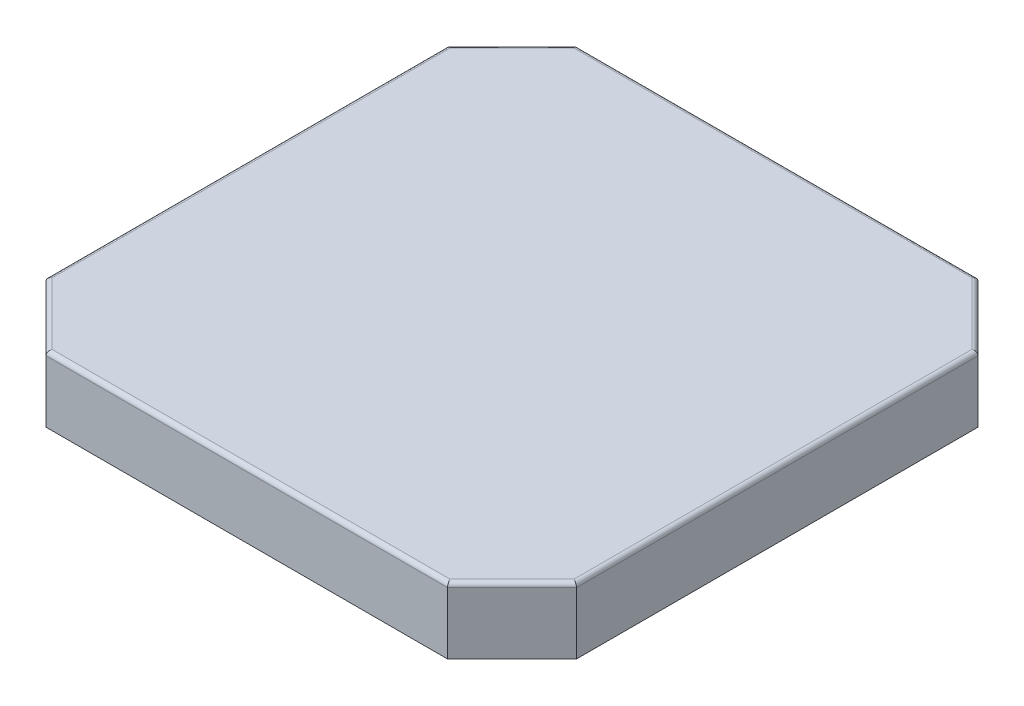
ISO-10303-21;
HEADER;
FILE_DESCRIPTION(('STEP AP214'),'2;1');
FILE_NAME('part.step','',(''),(''),'','','');
FILE_SCHEMA(('AUTOMOTIVE_DESIGN { 1 0 10303 214 1 1 1 1 }'));
ENDSEC;
DATA;
#1=APPLICATION_CONTEXT('core data for automotive mechanical design processes');
#2=APPLICATION_PROTOCOL_DEFINITION('international standard','automotive_design',2000,#1);
#3=PRODUCT_CONTEXT('',#1,'mechanical');
#4=PRODUCT('Part','Part','',(#3));
#5=PRODUCT_RELATED_PRODUCT_CATEGORY('part','',(#4));
#6=PRODUCT_DEFINITION_FORMATION('','',#4);
#7=PRODUCT_DEFINITION_CONTEXT('part definition',#1,'design');
#8=PRODUCT_DEFINITION('design','',#6,#7);
#9=PRODUCT_DEFINITION_SHAPE('','',#8);
#10=(LENGTH_UNIT() NAMED_UNIT(*) SI_UNIT(.MILLI.,.METRE.));
#11=(NAMED_UNIT(*) PLANE_ANGLE_UNIT() SI_UNIT($,.RADIAN.));
#12=(NAMED_UNIT(*) SI_UNIT($,.STERADIAN.) SOLID_ANGLE_UNIT());
#13=UNCERTAINTY_MEASURE_WITH_UNIT(LENGTH_MEASURE(1.E-05),#10,'distance_accuracy_value','');
#14=(GEOMETRIC_REPRESENTATION_CONTEXT(3) GLOBAL_UNCERTAINTY_ASSIGNED_CONTEXT((#13)) GLOBAL_UNIT_ASSIGNED_CONTEXT((#10,
#11,#12)) REPRESENTATION_CONTEXT('',''));
#15=CARTESIAN_POINT('',(0.,0.,0.));
#16=DIRECTION('',(0.,0.,1.));
#17=DIRECTION('',(1.,0.,0.));
#18=AXIS2_PLACEMENT_3D('',#15,#16,#17);
#19=CARTESIAN_POINT('',(0.,3.08,-24.7));
#20=DIRECTION('',(0.,0.,1.));
#21=DIRECTION('',(1.,0.,0.));
#22=AXIS2_PLACEMENT_3D('',#19,#20,#21);
#23=PLANE('',#22);
#24=DIRECTION('',(-1.,0.,0.));
#25=VECTOR('',#24,1.);
#26=CARTESIAN_POINT('',(0.,0.,-24.7));
#27=LINE('',#26,#25);
#28=CARTESIAN_POINT('',(21.7,0.,-24.7));
#29=VERTEX_POINT('',#28);
#30=CARTESIAN_POINT('',(15.35,0.,-24.7));
#31=VERTEX_POINT('',#30);
#32=EDGE_CURVE('E288',#29,#31,#27,.T.);
#33=ORIENTED_EDGE('',*,*,#32,.T.);
#34=DIRECTION('',(0.,-1.,0.));
#35=VECTOR('',#34,1.);
#36=CARTESIAN_POINT('',(15.35,0.,-24.7));
#37=LINE('',#36,#35);
#38=CARTESIAN_POINT('',(15.35,2.88,-24.7));
#39=VERTEX_POINT('',#38);
#40=EDGE_CURVE('E262',#39,#31,#37,.T.);
#41=ORIENTED_EDGE('',*,*,#40,.F.);
#42=DIRECTION('',(-1.,0.,0.));
#43=VECTOR('',#42,1.);
#44=CARTESIAN_POINT('',(0.,2.88,-24.7));
#45=LINE('',#44,#43);
#46=CARTESIAN_POINT('',(21.7,2.88,-24.7));
#47=VERTEX_POINT('',#46);
#48=EDGE_CURVE('E349',#39,#47,#45,.F.);
#49=ORIENTED_EDGE('',*,*,#48,.T.);
#50=DIRECTION('',(0.,-1.,0.));
#51=VECTOR('',#50,1.);
#52=CARTESIAN_POINT('',(21.7,3.08,-24.7));
#53=LINE('',#52,#51);
#54=EDGE_CURVE('E305',#47,#29,#53,.T.);
#55=ORIENTED_EDGE('',*,*,#54,.T.);
#56=EDGE_LOOP('',(#33,#41,#49,#55));
#57=FACE_BOUND('',#56,.T.);
#58=ADVANCED_FACE('F35',(#57),#23,.F.);
#59=CARTESIAN_POINT('',(0.,3.08,0.));
#60=DIRECTION('',(1.,0.,0.));
#61=DIRECTION('',(0.,0.,-1.));
#62=AXIS2_PLACEMENT_3D('',#59,#60,#61);
#63=PLANE('',#62);
#64=DIRECTION('',(0.,1.,0.));
#65=VECTOR('',#64,1.);
#66=CARTESIAN_POINT('',(0.,3.08,-3.00000000000001));
#67=LINE('',#66,#65);
#68=CARTESIAN_POINT('',(0.,0.,-3.00000000000001));
#69=VERTEX_POINT('',#68);
#70=CARTESIAN_POINT('',(0.,2.88,-3.00000000000001));
#71=VERTEX_POINT('',#70);
#72=EDGE_CURVE('E291',#69,#71,#67,.T.);
#73=ORIENTED_EDGE('',*,*,#72,.T.);
#74=DIRECTION('',(0.,0.,1.));
#75=VECTOR('',#74,1.);
#76=CARTESIAN_POINT('',(0.,2.88,0.));
#77=LINE('',#76,#75);
#78=CARTESIAN_POINT('',(0.,2.88,-21.7));
#79=VERTEX_POINT('',#78);
#80=EDGE_CURVE('E336',#71,#79,#77,.F.);
#81=ORIENTED_EDGE('',*,*,#80,.T.);
#82=DIRECTION('',(0.,-1.,0.));
#83=VECTOR('',#82,1.);
#84=CARTESIAN_POINT('',(0.,3.08,-21.7));
#85=LINE('',#84,#83);
#86=CARTESIAN_POINT('',(0.,0.,-21.7));
#87=VERTEX_POINT('',#86);
#88=EDGE_CURVE('E294',#79,#87,#85,.T.);
#89=ORIENTED_EDGE('',*,*,#88,.T.);
#90=DIRECTION('',(0.,0.,1.));
#91=VECTOR('',#90,1.);
#92=CARTESIAN_POINT('',(0.,0.,0.));
#93=LINE('',#92,#91);
#94=EDGE_CURVE('E277',#87,#69,#93,.T.);
#95=ORIENTED_EDGE('',*,*,#94,.T.);
#96=EDGE_LOOP('',(#73,#81,#89,#95));
#97=FACE_BOUND('',#96,.T.);
#98=ADVANCED_FACE('F433',(#97),#63,.F.);
#99=CARTESIAN_POINT('',(0.,3.08,0.));
#100=DIRECTION('',(0.,0.,-1.));
#101=DIRECTION('',(-1.,0.,0.));
#102=AXIS2_PLACEMENT_3D('',#99,#100,#101);
#103=PLANE('',#102);
#104=DIRECTION('',(0.,1.,0.));
#105=VECTOR('',#104,1.);
#106=CARTESIAN_POINT('',(21.7,3.08,0.));
#107=LINE('',#106,#105);
#108=CARTESIAN_POINT('',(21.7,0.,0.));
#109=VERTEX_POINT('',#108);
#110=CARTESIAN_POINT('',(21.7,2.88,0.));
#111=VERTEX_POINT('',#110);
#112=EDGE_CURVE('E316',#109,#111,#107,.T.);
#113=ORIENTED_EDGE('',*,*,#112,.T.);
#114=DIRECTION('',(1.,0.,0.));
#115=VECTOR('',#114,1.);
#116=CARTESIAN_POINT('',(0.,2.88,0.));
#117=LINE('',#116,#115);
#118=CARTESIAN_POINT('',(3.,2.88,0.));
#119=VERTEX_POINT('',#118);
#120=EDGE_CURVE('E341',#111,#119,#117,.F.);
#121=ORIENTED_EDGE('',*,*,#120,.T.);
#122=DIRECTION('',(0.,-1.,0.));
#123=VECTOR('',#122,1.);
#124=CARTESIAN_POINT('',(3.,3.08,0.));
#125=LINE('',#124,#123);
#126=CARTESIAN_POINT('',(3.,0.,0.));
#127=VERTEX_POINT('',#126);
#128=EDGE_CURVE('E314',#119,#127,#125,.T.);
#129=ORIENTED_EDGE('',*,*,#128,.T.);
#130=DIRECTION('',(1.,0.,0.));
#131=VECTOR('',#130,1.);
#132=CARTESIAN_POINT('',(0.,0.,0.));
#133=LINE('',#132,#131);
#134=EDGE_CURVE('E280',#127,#109,#133,.T.);
#135=ORIENTED_EDGE('',*,*,#134,.T.);
#136=EDGE_LOOP('',(#113,#121,#129,#135));
#137=FACE_BOUND('',#136,.T.);
#138=ADVANCED_FACE('F426',(#137),#103,.F.);
#139=CARTESIAN_POINT('',(24.7,3.08,0.));
#140=DIRECTION('',(-1.,0.,0.));
#141=DIRECTION('',(0.,0.,1.));
#142=AXIS2_PLACEMENT_3D('',#139,#140,#141);
#143=PLANE('',#142);
#144=DIRECTION('',(0.,1.,0.));
#145=VECTOR('',#144,1.);
#146=CARTESIAN_POINT('',(24.7,3.08,-21.7));
#147=LINE('',#146,#145);
#148=CARTESIAN_POINT('',(24.7,0.,-21.7));
#149=VERTEX_POINT('',#148);
#150=CARTESIAN_POINT('',(24.7,2.88,-21.7));
#151=VERTEX_POINT('',#150);
#152=EDGE_CURVE('E311',#149,#151,#147,.T.);
#153=ORIENTED_EDGE('',*,*,#152,.T.);
#154=DIRECTION('',(0.,0.,-1.));
#155=VECTOR('',#154,1.);
#156=CARTESIAN_POINT('',(24.7,2.88,0.));
#157=LINE('',#156,#155);
#158=CARTESIAN_POINT('',(24.7,2.88,-3.));
#159=VERTEX_POINT('',#158);
#160=EDGE_CURVE('E345',#151,#159,#157,.F.);
#161=ORIENTED_EDGE('',*,*,#160,.T.);
#162=DIRECTION('',(0.,-1.,0.));
#163=VECTOR('',#162,1.);
#164=CARTESIAN_POINT('',(24.7,3.08,-3.));
#165=LINE('',#164,#163);
#166=CARTESIAN_POINT('',(24.7,0.,-3.));
#167=VERTEX_POINT('',#166);
#168=EDGE_CURVE('E309',#159,#167,#165,.T.);
#169=ORIENTED_EDGE('',*,*,#168,.T.);
#170=DIRECTION('',(0.,0.,-1.));
#171=VECTOR('',#170,1.);
#172=CARTESIAN_POINT('',(24.7,0.,0.));
#173=LINE('',#172,#171);
#174=EDGE_CURVE('E284',#167,#149,#173,.T.);
#175=ORIENTED_EDGE('',*,*,#174,.T.);
#176=EDGE_LOOP('',(#153,#161,#169,#175));
#177=FACE_BOUND('',#176,.T.);
#178=ADVANCED_FACE('F385',(#177),#143,.F.);
#179=CARTESIAN_POINT('',(3.00000000000002,2.88,-24.7));
#180=VERTEX_POINT('',#179);
#181=CARTESIAN_POINT('',(9.35,2.88,-24.7));
#182=VERTEX_POINT('',#181);
#183=EDGE_CURVE('E350',#180,#182,#45,.F.);
#184=ORIENTED_EDGE('',*,*,#183,.T.);
#185=DIRECTION('',(0.,1.,0.));
#186=VECTOR('',#185,1.);
#187=CARTESIAN_POINT('',(9.35,0.,-24.7));
#188=LINE('',#187,#186);
#189=CARTESIAN_POINT('',(9.35,0.,-24.7));
#190=VERTEX_POINT('',#189);
#191=EDGE_CURVE('E265',#190,#182,#188,.T.);
#192=ORIENTED_EDGE('',*,*,#191,.F.);
#193=CARTESIAN_POINT('',(3.00000000000002,0.,-24.7));
#194=VERTEX_POINT('',#193);
#195=EDGE_CURVE('E287',#190,#194,#27,.T.);
#196=ORIENTED_EDGE('',*,*,#195,.T.);
#197=DIRECTION('',(0.,1.,0.));
#198=VECTOR('',#197,1.);
#199=CARTESIAN_POINT('',(3.00000000000002,3.08,-24.7));
#200=LINE('',#199,#198);
#201=EDGE_CURVE('E307',#194,#180,#200,.T.);
#202=ORIENTED_EDGE('',*,*,#201,.T.);
#203=EDGE_LOOP('',(#184,#192,#196,#202));
#204=FACE_BOUND('',#203,.T.);
#205=ADVANCED_FACE('F441',(#204),#23,.F.);
#206=CARTESIAN_POINT('',(0.,3.08,0.));
#207=DIRECTION('',(0.,-1.,0.));
#208=DIRECTION('',(0.,0.,-1.));
#209=AXIS2_PLACEMENT_3D('',#206,#207,#208);
#210=PLANE('',#209);
#211=DIRECTION('',(0.707106781186549,0.,-0.707106781186546));
#212=VECTOR('',#211,1.);
#213=CARTESIAN_POINT('',(0.141421356237311,3.08,-21.5585786437627));
#214=LINE('',#213,#212);
#215=CARTESIAN_POINT('',(3.08284271247464,3.08,-24.5));
#216=VERTEX_POINT('',#215);
#217=CARTESIAN_POINT('',(0.2,3.08,-21.6171572875254));
#218=VERTEX_POINT('',#217);
#219=EDGE_CURVE('E319',#216,#218,#214,.F.);
#220=ORIENTED_EDGE('',*,*,#219,.T.);
#221=DIRECTION('',(0.,0.,1.));
#222=VECTOR('',#221,1.);
#223=CARTESIAN_POINT('',(0.2,3.08,0.));
#224=LINE('',#223,#222);
#225=CARTESIAN_POINT('',(0.2,3.08,-3.08284271247463));
#226=VERTEX_POINT('',#225);
#227=EDGE_CURVE('E333',#218,#226,#224,.T.);
#228=ORIENTED_EDGE('',*,*,#227,.T.);
#229=DIRECTION('',(-0.707106781186546,0.,-0.707106781186549));
#230=VECTOR('',#229,1.);
#231=CARTESIAN_POINT('',(3.14142135623731,3.08,-0.14142135623731));
#232=LINE('',#231,#230);
#233=CARTESIAN_POINT('',(3.08284271247462,3.08,-0.2));
#234=VERTEX_POINT('',#233);
#235=EDGE_CURVE('E331',#226,#234,#232,.F.);
#236=ORIENTED_EDGE('',*,*,#235,.T.);
#237=DIRECTION('',(1.,0.,0.));
#238=VECTOR('',#237,1.);
#239=CARTESIAN_POINT('',(0.,3.08,-0.2));
#240=LINE('',#239,#238);
#241=CARTESIAN_POINT('',(21.6171572875254,3.08,-0.199999999999999));
#242=VERTEX_POINT('',#241);
#243=EDGE_CURVE('E329',#234,#242,#240,.T.);
#244=ORIENTED_EDGE('',*,*,#243,.T.);
#245=DIRECTION('',(-0.707106781186549,0.,0.707106781186546));
#246=VECTOR('',#245,1.);
#247=CARTESIAN_POINT('',(24.5585786437627,3.08,-3.14142135623731));
#248=LINE('',#247,#246);
#249=CARTESIAN_POINT('',(24.5,3.08,-3.08284271247462));
#250=VERTEX_POINT('',#249);
#251=EDGE_CURVE('E327',#242,#250,#248,.F.);
#252=ORIENTED_EDGE('',*,*,#251,.T.);
#253=DIRECTION('',(0.,0.,-1.));
#254=VECTOR('',#253,1.);
#255=CARTESIAN_POINT('',(24.5,3.08,0.));
#256=LINE('',#255,#254);
#257=CARTESIAN_POINT('',(24.5,3.08,-21.6171572875254));
#258=VERTEX_POINT('',#257);
#259=EDGE_CURVE('E325',#250,#258,#256,.T.);
#260=ORIENTED_EDGE('',*,*,#259,.T.);
#261=DIRECTION('',(0.707106781186546,0.,0.707106781186549));
#262=VECTOR('',#261,1.);
#263=CARTESIAN_POINT('',(21.5585786437627,3.08,-24.5585786437627));
#264=LINE('',#263,#262);
#265=CARTESIAN_POINT('',(21.6171572875254,3.08,-24.5));
#266=VERTEX_POINT('',#265);
#267=EDGE_CURVE('E323',#258,#266,#264,.F.);
#268=ORIENTED_EDGE('',*,*,#267,.T.);
#269=DIRECTION('',(-1.,0.,0.));
#270=VECTOR('',#269,1.);
#271=CARTESIAN_POINT('',(0.,3.08,-24.5));
#272=LINE('',#271,#270);
#273=EDGE_CURVE('E321',#266,#216,#272,.T.);
#274=ORIENTED_EDGE('',*,*,#273,.T.);
#275=EDGE_LOOP('',(#220,#228,#236,#244,#252,#260,#268,#274));
#276=FACE_BOUND('',#275,.T.);
#277=ADVANCED_FACE('F412',(#276),#210,.F.);
#278=CARTESIAN_POINT('',(0.,0.,0.));
#279=DIRECTION('',(0.,-1.,0.));
#280=DIRECTION('',(0.,0.,-1.));
#281=AXIS2_PLACEMENT_3D('',#278,#279,#280);
#282=PLANE('',#281);
#283=DIRECTION('',(1.,0.,0.));
#284=VECTOR('',#283,1.);
#285=CARTESIAN_POINT('',(3.12426406871193,0.,-24.4));
#286=LINE('',#285,#284);
#287=CARTESIAN_POINT('',(3.12426406871193,0.,-24.4));
#288=VERTEX_POINT('',#287);
#289=CARTESIAN_POINT('',(9.35,0.,-24.4));
#290=VERTEX_POINT('',#289);
#291=EDGE_CURVE('E222',#288,#290,#286,.T.);
#292=ORIENTED_EDGE('',*,*,#291,.F.);
#293=DIRECTION('',(0.707106781186548,0.,-0.707106781186548));
#294=VECTOR('',#293,1.);
#295=CARTESIAN_POINT('',(3.12426406871193,0.,-24.4));
#296=LINE('',#295,#294);
#297=CARTESIAN_POINT('',(0.300000000000001,0.,-21.5757359312881));
#298=VERTEX_POINT('',#297);
#299=EDGE_CURVE('E460',#298,#288,#296,.T.);
#300=ORIENTED_EDGE('',*,*,#299,.F.);
#301=DIRECTION('',(0.,0.,-1.));
#302=VECTOR('',#301,1.);
#303=CARTESIAN_POINT('',(0.299999999999999,0.,-3.12426406871193));
#304=LINE('',#303,#302);
#305=CARTESIAN_POINT('',(0.299999999999999,0.,-3.12426406871193));
#306=VERTEX_POINT('',#305);
#307=EDGE_CURVE('E456',#306,#298,#304,.T.);
#308=ORIENTED_EDGE('',*,*,#307,.F.);
#309=DIRECTION('',(-0.707106781186548,0.,-0.707106781186548));
#310=VECTOR('',#309,1.);
#311=CARTESIAN_POINT('',(3.12426406871193,0.,-0.3));
#312=LINE('',#311,#310);
#313=CARTESIAN_POINT('',(3.12426406871193,0.,-0.3));
#314=VERTEX_POINT('',#313);
#315=EDGE_CURVE('E461',#314,#306,#312,.T.);
#316=ORIENTED_EDGE('',*,*,#315,.F.);
#317=DIRECTION('',(-1.,0.,0.));
#318=VECTOR('',#317,1.);
#319=CARTESIAN_POINT('',(3.12426406871193,0.,-0.3));
#320=LINE('',#319,#318);
#321=CARTESIAN_POINT('',(21.5757359312881,0.,-0.299999999999997));
#322=VERTEX_POINT('',#321);
#323=EDGE_CURVE('E466',#322,#314,#320,.T.);
#324=ORIENTED_EDGE('',*,*,#323,.F.);
#325=DIRECTION('',(-0.707106781186548,0.,0.707106781186547));
#326=VECTOR('',#325,1.);
#327=CARTESIAN_POINT('',(21.5757359312881,0.,-0.299999999999997));
#328=LINE('',#327,#326);
#329=CARTESIAN_POINT('',(24.4,0.,-3.12426406871193));
#330=VERTEX_POINT('',#329);
#331=EDGE_CURVE('E469',#330,#322,#328,.T.);
#332=ORIENTED_EDGE('',*,*,#331,.F.);
#333=DIRECTION('',(0.,0.,1.));
#334=VECTOR('',#333,1.);
#335=CARTESIAN_POINT('',(24.4,0.,-3.12426406871193));
#336=LINE('',#335,#334);
#337=CARTESIAN_POINT('',(24.4,0.,-21.5757359312881));
#338=VERTEX_POINT('',#337);
#339=EDGE_CURVE('E214',#338,#330,#336,.T.);
#340=ORIENTED_EDGE('',*,*,#339,.F.);
#341=DIRECTION('',(0.707106781186547,0.,0.707106781186548));
#342=VECTOR('',#341,1.);
#343=CARTESIAN_POINT('',(24.4,0.,-21.5757359312881));
#344=LINE('',#343,#342);
#345=CARTESIAN_POINT('',(21.5757359312881,0.,-24.4));
#346=VERTEX_POINT('',#345);
#347=EDGE_CURVE('E228',#346,#338,#344,.T.);
#348=ORIENTED_EDGE('',*,*,#347,.F.);
#349=CARTESIAN_POINT('',(15.35,0.,-24.4));
#350=VERTEX_POINT('',#349);
#351=EDGE_CURVE('E224',#350,#346,#286,.T.);
#352=ORIENTED_EDGE('',*,*,#351,.F.);
#353=DIRECTION('',(0.,0.,-1.));
#354=VECTOR('',#353,1.);
#355=CARTESIAN_POINT('',(15.35,0.,-2.61999999999998));
#356=LINE('',#355,#354);
#357=EDGE_CURVE('E269',#350,#31,#356,.T.);
#358=ORIENTED_EDGE('',*,*,#357,.T.);
#359=ORIENTED_EDGE('',*,*,#32,.F.);
#360=DIRECTION('',(-0.707106781186546,0.,-0.707106781186549));
#361=VECTOR('',#360,1.);
#362=CARTESIAN_POINT('',(23.2,0.,-23.2));
#363=LINE('',#362,#361);
#364=EDGE_CURVE('E300',#29,#149,#363,.F.);
#365=ORIENTED_EDGE('',*,*,#364,.T.);
#366=ORIENTED_EDGE('',*,*,#174,.F.);
#367=DIRECTION('',(0.707106781186549,0.,-0.707106781186546));
#368=VECTOR('',#367,1.);
#369=CARTESIAN_POINT('',(10.85,0.,10.85));
#370=LINE('',#369,#368);
#371=EDGE_CURVE('E298',#167,#109,#370,.F.);
#372=ORIENTED_EDGE('',*,*,#371,.T.);
#373=ORIENTED_EDGE('',*,*,#134,.F.);
#374=DIRECTION('',(0.707106781186546,0.,0.707106781186549));
#375=VECTOR('',#374,1.);
#376=CARTESIAN_POINT('',(1.50000000000001,0.,-1.5));
#377=LINE('',#376,#375);
#378=EDGE_CURVE('E296',#127,#69,#377,.F.);
#379=ORIENTED_EDGE('',*,*,#378,.T.);
#380=ORIENTED_EDGE('',*,*,#94,.F.);
#381=DIRECTION('',(-0.707106781186549,0.,0.707106781186546));
#382=VECTOR('',#381,1.);
#383=CARTESIAN_POINT('',(-10.85,0.,-10.85));
#384=LINE('',#383,#382);
#385=EDGE_CURVE('E302',#87,#194,#384,.F.);
#386=ORIENTED_EDGE('',*,*,#385,.T.);
#387=ORIENTED_EDGE('',*,*,#195,.F.);
#388=DIRECTION('',(0.,0.,-1.));
#389=VECTOR('',#388,1.);
#390=CARTESIAN_POINT('',(9.35,0.,-2.61999999999998));
#391=LINE('',#390,#389);
#392=EDGE_CURVE('E274',#290,#190,#391,.T.);
#393=ORIENTED_EDGE('',*,*,#392,.F.);
#394=EDGE_LOOP('',(#292,#300,#308,#316,#324,#332,#340,#348,#352,#358,#359,#365,#366,#372,#373,
#379,#380,#386,#387,#393));
#395=FACE_BOUND('',#394,.T.);
#396=ADVANCED_FACE('F395',(#395),#282,.T.);
#397=CARTESIAN_POINT('',(0.,3.08,-21.7));
#398=DIRECTION('',(0.707106781186546,0.,0.707106781186549));
#399=DIRECTION('',(0.,-1.,0.));
#400=AXIS2_PLACEMENT_3D('',#397,#398,#399);
#401=PLANE('',#400);
#402=ORIENTED_EDGE('',*,*,#88,.F.);
#403=DIRECTION('',(-0.707106781186549,0.,0.707106781186546));
#404=VECTOR('',#403,1.);
#405=CARTESIAN_POINT('',(3.00000000000002,2.88,-24.7));
#406=LINE('',#405,#404);
#407=EDGE_CURVE('E43',#79,#180,#406,.F.);
#408=ORIENTED_EDGE('',*,*,#407,.T.);
#409=ORIENTED_EDGE('',*,*,#201,.F.);
#410=ORIENTED_EDGE('',*,*,#385,.F.);
#411=EDGE_LOOP('',(#402,#408,#409,#410));
#412=FACE_BOUND('',#411,.T.);
#413=ADVANCED_FACE('F436',(#412),#401,.F.);
#414=CARTESIAN_POINT('',(21.7,3.08,-24.7));
#415=DIRECTION('',(-0.707106781186549,0.,0.707106781186546));
#416=DIRECTION('',(0.,-1.,0.));
#417=AXIS2_PLACEMENT_3D('',#414,#415,#416);
#418=PLANE('',#417);
#419=ORIENTED_EDGE('',*,*,#54,.F.);
#420=DIRECTION('',(-0.707106781186546,0.,-0.707106781186549));
#421=VECTOR('',#420,1.);
#422=CARTESIAN_POINT('',(24.7,2.88,-21.7));
#423=LINE('',#422,#421);
#424=EDGE_CURVE('E347',#47,#151,#423,.F.);
#425=ORIENTED_EDGE('',*,*,#424,.T.);
#426=ORIENTED_EDGE('',*,*,#152,.F.);
#427=ORIENTED_EDGE('',*,*,#364,.F.);
#428=EDGE_LOOP('',(#419,#425,#426,#427));
#429=FACE_BOUND('',#428,.T.);
#430=ADVANCED_FACE('F400',(#429),#418,.F.);
#431=CARTESIAN_POINT('',(24.7,3.08,-3.));
#432=DIRECTION('',(-0.707106781186546,0.,-0.707106781186549));
#433=DIRECTION('',(0.,-1.,0.));
#434=AXIS2_PLACEMENT_3D('',#431,#432,#433);
#435=PLANE('',#434);
#436=ORIENTED_EDGE('',*,*,#168,.F.);
#437=DIRECTION('',(0.707106781186549,0.,-0.707106781186546));
#438=VECTOR('',#437,1.);
#439=CARTESIAN_POINT('',(21.7,2.88,0.));
#440=LINE('',#439,#438);
#441=EDGE_CURVE('E343',#159,#111,#440,.F.);
#442=ORIENTED_EDGE('',*,*,#441,.T.);
#443=ORIENTED_EDGE('',*,*,#112,.F.);
#444=ORIENTED_EDGE('',*,*,#371,.F.);
#445=EDGE_LOOP('',(#436,#442,#443,#444));
#446=FACE_BOUND('',#445,.T.);
#447=ADVANCED_FACE('F389',(#446),#435,.F.);
#448=CARTESIAN_POINT('',(3.,3.08,0.));
#449=DIRECTION('',(0.707106781186549,0.,-0.707106781186546));
#450=DIRECTION('',(0.,-1.,0.));
#451=AXIS2_PLACEMENT_3D('',#448,#449,#450);
#452=PLANE('',#451);
#453=ORIENTED_EDGE('',*,*,#128,.F.);
#454=DIRECTION('',(0.707106781186546,0.,0.707106781186549));
#455=VECTOR('',#454,1.);
#456=CARTESIAN_POINT('',(0.,2.88,-3.00000000000001));
#457=LINE('',#456,#455);
#458=EDGE_CURVE('E339',#119,#71,#457,.F.);
#459=ORIENTED_EDGE('',*,*,#458,.T.);
#460=ORIENTED_EDGE('',*,*,#72,.F.);
#461=ORIENTED_EDGE('',*,*,#378,.F.);
#462=EDGE_LOOP('',(#453,#459,#460,#461));
#463=FACE_BOUND('',#462,.T.);
#464=ADVANCED_FACE('F429',(#463),#452,.F.);
#465=CARTESIAN_POINT('',(24.5,2.88,0.));
#466=DIRECTION('',(0.,0.,-1.));
#467=DIRECTION('',(-1.,0.,0.));
#468=AXIS2_PLACEMENT_3D('',#465,#466,#467);
#469=CYLINDRICAL_SURFACE('',#468,0.2);
#470=CARTESIAN_POINT('',(24.5,2.88,-3.08284271247462));
#471=DIRECTION('',(0.382683432365091,0.,-0.923879532511287));
#472=DIRECTION('',(-0.923879532511287,0.,-0.382683432365091));
#473=AXIS2_PLACEMENT_3D('',#470,#471,#472);
#474=ELLIPSE('',#473,0.216478440058479,0.2);
#475=EDGE_CURVE('E369',#159,#250,#474,.F.);
#476=ORIENTED_EDGE('',*,*,#475,.F.);
#477=ORIENTED_EDGE('',*,*,#160,.F.);
#478=CARTESIAN_POINT('',(24.5,2.88,-21.6171572875254));
#479=DIRECTION('',(-0.382683432365089,0.,-0.923879532511287));
#480=DIRECTION('',(-0.923879532511287,0.,0.382683432365089));
#481=AXIS2_PLACEMENT_3D('',#478,#479,#480);
#482=ELLIPSE('',#481,0.216478440058479,0.2);
#483=EDGE_CURVE('E281',#258,#151,#482,.T.);
#484=ORIENTED_EDGE('',*,*,#483,.F.);
#485=ORIENTED_EDGE('',*,*,#259,.F.);
#486=EDGE_LOOP('',(#476,#477,#484,#485));
#487=FACE_BOUND('',#486,.T.);
#488=ADVANCED_FACE('F37',(#487),#469,.T.);
#489=CARTESIAN_POINT('',(23.0585786437627,2.88,-23.0585786437627));
#490=DIRECTION('',(-0.707106781186546,0.,-0.707106781186549));
#491=DIRECTION('',(-0.707106781186549,0.,0.707106781186546));
#492=AXIS2_PLACEMENT_3D('',#489,#490,#491);
#493=CYLINDRICAL_SURFACE('',#492,0.2);
#494=ORIENTED_EDGE('',*,*,#483,.T.);
#495=ORIENTED_EDGE('',*,*,#424,.F.);
#496=CARTESIAN_POINT('',(21.6171572875254,2.88,-24.5));
#497=DIRECTION('',(-0.923879532511287,0.,-0.382683432365091));
#498=DIRECTION('',(-0.382683432365091,0.,0.923879532511287));
#499=AXIS2_PLACEMENT_3D('',#496,#497,#498);
#500=ELLIPSE('',#499,0.216478440058479,0.2);
#501=EDGE_CURVE('E366',#266,#47,#500,.T.);
#502=ORIENTED_EDGE('',*,*,#501,.F.);
#503=ORIENTED_EDGE('',*,*,#267,.F.);
#504=EDGE_LOOP('',(#494,#495,#502,#503));
#505=FACE_BOUND('',#504,.T.);
#506=ADVANCED_FACE('F376',(#505),#493,.T.);
#507=CARTESIAN_POINT('',(10.7085786437626,2.88,10.7085786437627));
#508=DIRECTION('',(0.707106781186549,0.,-0.707106781186546));
#509=DIRECTION('',(-0.707106781186546,0.,-0.707106781186549));
#510=AXIS2_PLACEMENT_3D('',#507,#508,#509);
#511=CYLINDRICAL_SURFACE('',#510,0.2);
#512=ORIENTED_EDGE('',*,*,#475,.T.);
#513=ORIENTED_EDGE('',*,*,#251,.F.);
#514=CARTESIAN_POINT('',(21.6171572875254,2.88,-0.200000000000001));
#515=DIRECTION('',(0.923879532511287,0.,-0.382683432365089));
#516=DIRECTION('',(-0.382683432365089,0.,-0.923879532511287));
#517=AXIS2_PLACEMENT_3D('',#514,#515,#516);
#518=ELLIPSE('',#517,0.216478440058479,0.2);
#519=EDGE_CURVE('E363',#111,#242,#518,.F.);
#520=ORIENTED_EDGE('',*,*,#519,.F.);
#521=ORIENTED_EDGE('',*,*,#441,.F.);
#522=EDGE_LOOP('',(#512,#513,#520,#521));
#523=FACE_BOUND('',#522,.T.);
#524=ADVANCED_FACE('F418',(#523),#511,.T.);
#525=CARTESIAN_POINT('',(0.,2.88,-24.5));
#526=DIRECTION('',(-1.,0.,0.));
#527=DIRECTION('',(0.,0.,1.));
#528=AXIS2_PLACEMENT_3D('',#525,#526,#527);
#529=CYLINDRICAL_SURFACE('',#528,0.2);
#530=ORIENTED_EDGE('',*,*,#501,.T.);
#531=ORIENTED_EDGE('',*,*,#48,.F.);
#532=DIRECTION('',(1.,0.,0.));
#533=VECTOR('',#532,1.);
#534=CARTESIAN_POINT('',(15.35,2.88,-24.7));
#535=LINE('',#534,#533);
#536=EDGE_CURVE('E267',#182,#39,#535,.T.);
#537=ORIENTED_EDGE('',*,*,#536,.F.);
#538=ORIENTED_EDGE('',*,*,#183,.F.);
#539=CARTESIAN_POINT('',(3.08284271247464,2.88,-24.5));
#540=DIRECTION('',(-0.923879532511287,0.,0.382683432365089));
#541=DIRECTION('',(0.382683432365089,0.,0.923879532511287));
#542=AXIS2_PLACEMENT_3D('',#539,#540,#541);
#543=ELLIPSE('',#542,0.216478440058479,0.2);
#544=EDGE_CURVE('E360',#216,#180,#543,.T.);
#545=ORIENTED_EDGE('',*,*,#544,.F.);
#546=ORIENTED_EDGE('',*,*,#273,.F.);
#547=EDGE_LOOP('',(#530,#531,#537,#538,#545,#546));
#548=FACE_BOUND('',#547,.T.);
#549=ADVANCED_FACE('F406',(#548),#529,.T.);
#550=CARTESIAN_POINT('',(0.,2.88,-0.2));
#551=DIRECTION('',(1.,0.,0.));
#552=DIRECTION('',(0.,0.,-1.));
#553=AXIS2_PLACEMENT_3D('',#550,#551,#552);
#554=CYLINDRICAL_SURFACE('',#553,0.2);
#555=ORIENTED_EDGE('',*,*,#519,.T.);
#556=ORIENTED_EDGE('',*,*,#243,.F.);
#557=CARTESIAN_POINT('',(3.08284271247462,2.88,-0.2));
#558=DIRECTION('',(0.923879532511287,0.,0.382683432365091));
#559=DIRECTION('',(0.382683432365091,0.,-0.923879532511287));
#560=AXIS2_PLACEMENT_3D('',#557,#558,#559);
#561=ELLIPSE('',#560,0.216478440058479,0.2);
#562=EDGE_CURVE('E357',#119,#234,#561,.F.);
#563=ORIENTED_EDGE('',*,*,#562,.F.);
#564=ORIENTED_EDGE('',*,*,#120,.F.);
#565=EDGE_LOOP('',(#555,#556,#563,#564));
#566=FACE_BOUND('',#565,.T.);
#567=ADVANCED_FACE('F421',(#566),#554,.T.);
#568=CARTESIAN_POINT('',(-10.7085786437627,2.88,-10.7085786437627));
#569=DIRECTION('',(-0.707106781186549,0.,0.707106781186546));
#570=DIRECTION('',(0.707106781186546,0.,0.707106781186549));
#571=AXIS2_PLACEMENT_3D('',#568,#569,#570);
#572=CYLINDRICAL_SURFACE('',#571,0.2);
#573=ORIENTED_EDGE('',*,*,#544,.T.);
#574=ORIENTED_EDGE('',*,*,#407,.F.);
#575=CARTESIAN_POINT('',(0.200000000000001,2.88,-21.6171572875254));
#576=DIRECTION('',(-0.382683432365091,0.,0.923879532511286));
#577=DIRECTION('',(-0.923879532511286,0.,-0.382683432365091));
#578=AXIS2_PLACEMENT_3D('',#575,#576,#577);
#579=ELLIPSE('',#578,0.216478440058479,0.2);
#580=EDGE_CURVE('E355',#218,#79,#579,.T.);
#581=ORIENTED_EDGE('',*,*,#580,.F.);
#582=ORIENTED_EDGE('',*,*,#219,.F.);
#583=EDGE_LOOP('',(#573,#574,#581,#582));
#584=FACE_BOUND('',#583,.T.);
#585=ADVANCED_FACE('F525',(#584),#572,.T.);
#586=CARTESIAN_POINT('',(1.64142135623731,2.88,-1.64142135623731));
#587=DIRECTION('',(0.707106781186546,0.,0.707106781186549));
#588=DIRECTION('',(0.707106781186549,0.,-0.707106781186546));
#589=AXIS2_PLACEMENT_3D('',#586,#587,#588);
#590=CYLINDRICAL_SURFACE('',#589,0.2);
#591=ORIENTED_EDGE('',*,*,#562,.T.);
#592=ORIENTED_EDGE('',*,*,#235,.F.);
#593=CARTESIAN_POINT('',(0.2,2.88,-3.08284271247463));
#594=DIRECTION('',(0.382683432365089,0.,0.923879532511287));
#595=DIRECTION('',(0.923879532511287,0.,-0.382683432365089));
#596=AXIS2_PLACEMENT_3D('',#593,#594,#595);
#597=ELLIPSE('',#596,0.216478440058479,0.2);
#598=EDGE_CURVE('E272',#71,#226,#597,.F.);
#599=ORIENTED_EDGE('',*,*,#598,.F.);
#600=ORIENTED_EDGE('',*,*,#458,.F.);
#601=EDGE_LOOP('',(#591,#592,#599,#600));
#602=FACE_BOUND('',#601,.T.);
#603=ADVANCED_FACE('F521',(#602),#590,.T.);
#604=CARTESIAN_POINT('',(0.2,2.88,0.));
#605=DIRECTION('',(0.,0.,1.));
#606=DIRECTION('',(1.,0.,0.));
#607=AXIS2_PLACEMENT_3D('',#604,#605,#606);
#608=CYLINDRICAL_SURFACE('',#607,0.2);
#609=ORIENTED_EDGE('',*,*,#580,.T.);
#610=ORIENTED_EDGE('',*,*,#80,.F.);
#611=ORIENTED_EDGE('',*,*,#598,.T.);
#612=ORIENTED_EDGE('',*,*,#227,.F.);
#613=EDGE_LOOP('',(#609,#610,#611,#612));
#614=FACE_BOUND('',#613,.T.);
#615=ADVANCED_FACE('F517',(#614),#608,.T.);
#616=CARTESIAN_POINT('',(15.35,0.,-2.61999999999998));
#617=DIRECTION('',(1.,0.,0.));
#618=DIRECTION('',(0.,0.,-1.));
#619=AXIS2_PLACEMENT_3D('',#616,#617,#618);
#620=PLANE('',#619);
#621=ORIENTED_EDGE('',*,*,#357,.F.);
#622=DIRECTION('',(0.,1.,0.));
#623=VECTOR('',#622,1.);
#624=CARTESIAN_POINT('',(15.35,0.,-24.4));
#625=LINE('',#624,#623);
#626=CARTESIAN_POINT('',(15.35,2.88,-24.4));
#627=VERTEX_POINT('',#626);
#628=EDGE_CURVE('E259',#350,#627,#625,.T.);
#629=ORIENTED_EDGE('',*,*,#628,.T.);
#630=DIRECTION('',(0.,0.,-1.));
#631=VECTOR('',#630,1.);
#632=CARTESIAN_POINT('',(15.35,2.88,-2.61999999999998));
#633=LINE('',#632,#631);
#634=EDGE_CURVE('E270',#627,#39,#633,.T.);
#635=ORIENTED_EDGE('',*,*,#634,.T.);
#636=ORIENTED_EDGE('',*,*,#40,.T.);
#637=EDGE_LOOP('',(#621,#629,#635,#636));
#638=FACE_BOUND('',#637,.T.);
#639=ADVANCED_FACE('F520',(#638),#620,.F.);
#640=CARTESIAN_POINT('',(15.35,2.88,-2.61999999999998));
#641=DIRECTION('',(0.,1.,0.));
#642=DIRECTION('',(0.,0.,1.));
#643=AXIS2_PLACEMENT_3D('',#640,#641,#642);
#644=PLANE('',#643);
#645=ORIENTED_EDGE('',*,*,#634,.F.);
#646=DIRECTION('',(1.,0.,0.));
#647=VECTOR('',#646,1.);
#648=CARTESIAN_POINT('',(3.12426406871193,2.88,-24.4));
#649=LINE('',#648,#647);
#650=CARTESIAN_POINT('',(21.5757359312881,2.88,-24.4));
#651=VERTEX_POINT('',#650);
#652=EDGE_CURVE('E235',#627,#651,#649,.T.);
#653=ORIENTED_EDGE('',*,*,#652,.T.);
#654=DIRECTION('',(0.707106781186547,0.,0.707106781186548));
#655=VECTOR('',#654,1.);
#656=CARTESIAN_POINT('',(24.4,2.88,-21.5757359312881));
#657=LINE('',#656,#655);
#658=CARTESIAN_POINT('',(24.4,2.88,-21.5757359312881));
#659=VERTEX_POINT('',#658);
#660=EDGE_CURVE('E220',#651,#659,#657,.T.);
#661=ORIENTED_EDGE('',*,*,#660,.T.);
#662=DIRECTION('',(0.,0.,1.));
#663=VECTOR('',#662,1.);
#664=CARTESIAN_POINT('',(24.4,2.88,-3.12426406871193));
#665=LINE('',#664,#663);
#666=CARTESIAN_POINT('',(24.4,2.88,-3.12426406871193));
#667=VERTEX_POINT('',#666);
#668=EDGE_CURVE('E211',#659,#667,#665,.T.);
#669=ORIENTED_EDGE('',*,*,#668,.T.);
#670=DIRECTION('',(-0.707106781186548,0.,0.707106781186547));
#671=VECTOR('',#670,1.);
#672=CARTESIAN_POINT('',(21.5757359312881,2.88,-0.299999999999997));
#673=LINE('',#672,#671);
#674=CARTESIAN_POINT('',(21.5757359312881,2.88,-0.299999999999997));
#675=VERTEX_POINT('',#674);
#676=EDGE_CURVE('E199',#667,#675,#673,.T.);
#677=ORIENTED_EDGE('',*,*,#676,.T.);
#678=DIRECTION('',(-1.,0.,0.));
#679=VECTOR('',#678,1.);
#680=CARTESIAN_POINT('',(3.12426406871193,2.88,-0.3));
#681=LINE('',#680,#679);
#682=CARTESIAN_POINT('',(3.12426406871193,2.88,-0.3));
#683=VERTEX_POINT('',#682);
#684=EDGE_CURVE('E249',#675,#683,#681,.T.);
#685=ORIENTED_EDGE('',*,*,#684,.T.);
#686=DIRECTION('',(-0.707106781186547,0.,-0.707106781186548));
#687=VECTOR('',#686,1.);
#688=CARTESIAN_POINT('',(3.12426406871193,2.88,-0.3));
#689=LINE('',#688,#687);
#690=CARTESIAN_POINT('',(0.299999999999999,2.88,-3.12426406871193));
#691=VERTEX_POINT('',#690);
#692=EDGE_CURVE('E245',#683,#691,#689,.T.);
#693=ORIENTED_EDGE('',*,*,#692,.T.);
#694=DIRECTION('',(0.,0.,-1.));
#695=VECTOR('',#694,1.);
#696=CARTESIAN_POINT('',(0.299999999999999,2.88,-3.12426406871193));
#697=LINE('',#696,#695);
#698=CARTESIAN_POINT('',(0.300000000000001,2.88,-21.5757359312881));
#699=VERTEX_POINT('',#698);
#700=EDGE_CURVE('E241',#691,#699,#697,.T.);
#701=ORIENTED_EDGE('',*,*,#700,.T.);
#702=DIRECTION('',(0.707106781186548,0.,-0.707106781186548));
#703=VECTOR('',#702,1.);
#704=CARTESIAN_POINT('',(3.12426406871193,2.88,-24.4));
#705=LINE('',#704,#703);
#706=CARTESIAN_POINT('',(3.12426406871193,2.88,-24.4));
#707=VERTEX_POINT('',#706);
#708=EDGE_CURVE('E236',#699,#707,#705,.T.);
#709=ORIENTED_EDGE('',*,*,#708,.T.);
#710=CARTESIAN_POINT('',(9.35,2.88,-24.4));
#711=VERTEX_POINT('',#710);
#712=EDGE_CURVE('E233',#707,#711,#649,.T.);
#713=ORIENTED_EDGE('',*,*,#712,.T.);
#714=DIRECTION('',(0.,0.,-1.));
#715=VECTOR('',#714,1.);
#716=CARTESIAN_POINT('',(9.35,2.88,-2.61999999999998));
#717=LINE('',#716,#715);
#718=EDGE_CURVE('E50',#711,#182,#717,.T.);
#719=ORIENTED_EDGE('',*,*,#718,.T.);
#720=ORIENTED_EDGE('',*,*,#536,.T.);
#721=EDGE_LOOP('',(#645,#653,#661,#669,#677,#685,#693,#701,#709,#713,#719,#720));
#722=FACE_BOUND('',#721,.T.);
#723=ADVANCED_FACE('F218',(#722),#644,.F.);
#724=CARTESIAN_POINT('',(9.35,0.,-2.61999999999998));
#725=DIRECTION('',(-1.,0.,0.));
#726=DIRECTION('',(0.,0.,1.));
#727=AXIS2_PLACEMENT_3D('',#724,#725,#726);
#728=PLANE('',#727);
#729=ORIENTED_EDGE('',*,*,#718,.F.);
#730=DIRECTION('',(0.,-1.,0.));
#731=VECTOR('',#730,1.);
#732=CARTESIAN_POINT('',(9.35,0.,-24.4));
#733=LINE('',#732,#731);
#734=EDGE_CURVE('E11',#711,#290,#733,.T.);
#735=ORIENTED_EDGE('',*,*,#734,.T.);
#736=ORIENTED_EDGE('',*,*,#392,.T.);
#737=ORIENTED_EDGE('',*,*,#191,.T.);
#738=EDGE_LOOP('',(#729,#735,#736,#737));
#739=FACE_BOUND('',#738,.T.);
#740=ADVANCED_FACE('F443',(#739),#728,.F.);
#741=CARTESIAN_POINT('',(3.12426406871193,36.9625468531916,-24.4));
#742=DIRECTION('',(0.,0.,-1.));
#743=DIRECTION('',(-1.,0.,0.));
#744=AXIS2_PLACEMENT_3D('',#741,#742,#743);
#745=PLANE('',#744);
#746=ORIENTED_EDGE('',*,*,#351,.T.);
#747=DIRECTION('',(0.,-1.,0.));
#748=VECTOR('',#747,1.);
#749=CARTESIAN_POINT('',(21.5757359312881,36.9625468531916,-24.4));
#750=LINE('',#749,#748);
#751=EDGE_CURVE('E232',#651,#346,#750,.T.);
#752=ORIENTED_EDGE('',*,*,#751,.F.);
#753=ORIENTED_EDGE('',*,*,#652,.F.);
#754=ORIENTED_EDGE('',*,*,#628,.F.);
#755=EDGE_LOOP('',(#746,#752,#753,#754));
#756=FACE_BOUND('',#755,.T.);
#757=ADVANCED_FACE('F634',(#756),#745,.F.);
#758=ORIENTED_EDGE('',*,*,#712,.F.);
#759=DIRECTION('',(0.,-1.,0.));
#760=VECTOR('',#759,1.);
#761=CARTESIAN_POINT('',(3.12426406871193,36.9625468531916,-24.4));
#762=LINE('',#761,#760);
#763=EDGE_CURVE('E239',#707,#288,#762,.T.);
#764=ORIENTED_EDGE('',*,*,#763,.T.);
#765=ORIENTED_EDGE('',*,*,#291,.T.);
#766=ORIENTED_EDGE('',*,*,#734,.F.);
#767=EDGE_LOOP('',(#758,#764,#765,#766));
#768=FACE_BOUND('',#767,.T.);
#769=ADVANCED_FACE('F445',(#768),#745,.F.);
#770=CARTESIAN_POINT('',(24.4,36.9625468531916,-3.12426406871193));
#771=DIRECTION('',(1.,0.,0.));
#772=DIRECTION('',(0.,0.,-1.));
#773=AXIS2_PLACEMENT_3D('',#770,#771,#772);
#774=PLANE('',#773);
#775=DIRECTION('',(0.,-1.,0.));
#776=VECTOR('',#775,1.);
#777=CARTESIAN_POINT('',(24.4,36.9625468531916,-21.5757359312881));
#778=LINE('',#777,#776);
#779=EDGE_CURVE('E231',#659,#338,#778,.T.);
#780=ORIENTED_EDGE('',*,*,#779,.T.);
#781=ORIENTED_EDGE('',*,*,#339,.T.);
#782=DIRECTION('',(0.,-1.,0.));
#783=VECTOR('',#782,1.);
#784=CARTESIAN_POINT('',(24.4,36.9625468531916,-3.12426406871193));
#785=LINE('',#784,#783);
#786=EDGE_CURVE('E203',#667,#330,#785,.T.);
#787=ORIENTED_EDGE('',*,*,#786,.F.);
#788=ORIENTED_EDGE('',*,*,#668,.F.);
#789=EDGE_LOOP('',(#780,#781,#787,#788));
#790=FACE_BOUND('',#789,.T.);
#791=ADVANCED_FACE('F210',(#790),#774,.F.);
#792=CARTESIAN_POINT('',(21.5757359312881,36.9625468531916,-0.299999999999997));
#793=DIRECTION('',(0.707106781186547,0.,0.707106781186548));
#794=DIRECTION('',(0.707106781186548,0.,-0.707106781186547));
#795=AXIS2_PLACEMENT_3D('',#792,#793,#794);
#796=PLANE('',#795);
#797=ORIENTED_EDGE('',*,*,#786,.T.);
#798=ORIENTED_EDGE('',*,*,#331,.T.);
#799=DIRECTION('',(0.,-1.,0.));
#800=VECTOR('',#799,1.);
#801=CARTESIAN_POINT('',(21.5757359312881,36.9625468531916,-0.299999999999997));
#802=LINE('',#801,#800);
#803=EDGE_CURVE('E205',#675,#322,#802,.T.);
#804=ORIENTED_EDGE('',*,*,#803,.F.);
#805=ORIENTED_EDGE('',*,*,#676,.F.);
#806=EDGE_LOOP('',(#797,#798,#804,#805));
#807=FACE_BOUND('',#806,.T.);
#808=ADVANCED_FACE('F201',(#807),#796,.F.);
#809=CARTESIAN_POINT('',(3.12426406871193,36.9625468531916,-0.3));
#810=DIRECTION('',(0.,0.,1.));
#811=DIRECTION('',(1.,0.,0.));
#812=AXIS2_PLACEMENT_3D('',#809,#810,#811);
#813=PLANE('',#812);
#814=ORIENTED_EDGE('',*,*,#803,.T.);
#815=ORIENTED_EDGE('',*,*,#323,.T.);
#816=DIRECTION('',(0.,-1.,0.));
#817=VECTOR('',#816,1.);
#818=CARTESIAN_POINT('',(3.12426406871193,36.9625468531916,-0.3));
#819=LINE('',#818,#817);
#820=EDGE_CURVE('E248',#683,#314,#819,.T.);
#821=ORIENTED_EDGE('',*,*,#820,.F.);
#822=ORIENTED_EDGE('',*,*,#684,.F.);
#823=EDGE_LOOP('',(#814,#815,#821,#822));
#824=FACE_BOUND('',#823,.T.);
#825=ADVANCED_FACE('F479',(#824),#813,.F.);
#826=CARTESIAN_POINT('',(3.12426406871193,36.9625468531916,-0.3));
#827=DIRECTION('',(-0.707106781186548,0.,0.707106781186548));
#828=DIRECTION('',(0.707106781186547,0.,0.707106781186548));
#829=AXIS2_PLACEMENT_3D('',#826,#827,#828);
#830=PLANE('',#829);
#831=ORIENTED_EDGE('',*,*,#820,.T.);
#832=ORIENTED_EDGE('',*,*,#315,.T.);
#833=DIRECTION('',(0.,-1.,0.));
#834=VECTOR('',#833,1.);
#835=CARTESIAN_POINT('',(0.299999999999999,36.9625468531916,-3.12426406871193));
#836=LINE('',#835,#834);
#837=EDGE_CURVE('E244',#691,#306,#836,.T.);
#838=ORIENTED_EDGE('',*,*,#837,.F.);
#839=ORIENTED_EDGE('',*,*,#692,.F.);
#840=EDGE_LOOP('',(#831,#832,#838,#839));
#841=FACE_BOUND('',#840,.T.);
#842=ADVANCED_FACE('F481',(#841),#830,.F.);
#843=CARTESIAN_POINT('',(0.299999999999999,36.9625468531916,-3.12426406871193));
#844=DIRECTION('',(-1.,0.,0.));
#845=DIRECTION('',(0.,0.,1.));
#846=AXIS2_PLACEMENT_3D('',#843,#844,#845);
#847=PLANE('',#846);
#848=ORIENTED_EDGE('',*,*,#837,.T.);
#849=ORIENTED_EDGE('',*,*,#307,.T.);
#850=DIRECTION('',(0.,-1.,0.));
#851=VECTOR('',#850,1.);
#852=CARTESIAN_POINT('',(0.300000000000001,36.9625468531916,-21.5757359312881));
#853=LINE('',#852,#851);
#854=EDGE_CURVE('E240',#699,#298,#853,.T.);
#855=ORIENTED_EDGE('',*,*,#854,.F.);
#856=ORIENTED_EDGE('',*,*,#700,.F.);
#857=EDGE_LOOP('',(#848,#849,#855,#856));
#858=FACE_BOUND('',#857,.T.);
#859=ADVANCED_FACE('F453',(#858),#847,.F.);
#860=CARTESIAN_POINT('',(3.12426406871193,36.9625468531916,-24.4));
#861=DIRECTION('',(-0.707106781186548,0.,-0.707106781186548));
#862=DIRECTION('',(-0.707106781186548,0.,0.707106781186548));
#863=AXIS2_PLACEMENT_3D('',#860,#861,#862);
#864=PLANE('',#863);
#865=ORIENTED_EDGE('',*,*,#854,.T.);
#866=ORIENTED_EDGE('',*,*,#299,.T.);
#867=ORIENTED_EDGE('',*,*,#763,.F.);
#868=ORIENTED_EDGE('',*,*,#708,.F.);
#869=EDGE_LOOP('',(#865,#866,#867,#868));
#870=FACE_BOUND('',#869,.T.);
#871=ADVANCED_FACE('F449',(#870),#864,.F.);
#872=CARTESIAN_POINT('',(24.4,36.9625468531916,-21.5757359312881));
#873=DIRECTION('',(0.707106781186548,0.,-0.707106781186547));
#874=DIRECTION('',(-0.707106781186547,0.,-0.707106781186548));
#875=AXIS2_PLACEMENT_3D('',#872,#873,#874);
#876=PLANE('',#875);
#877=ORIENTED_EDGE('',*,*,#751,.T.);
#878=ORIENTED_EDGE('',*,*,#347,.T.);
#879=ORIENTED_EDGE('',*,*,#779,.F.);
#880=ORIENTED_EDGE('',*,*,#660,.F.);
#881=EDGE_LOOP('',(#877,#878,#879,#880));
#882=FACE_BOUND('',#881,.T.);
#883=ADVANCED_FACE('F473',(#882),#876,.F.);
#884=CLOSED_SHELL('',(#58,#98,#138,#178,#205,#277,#396,#413,#430,#447,#464,#488,#506,#524,#549,
#567,#585,#603,#615,#639,#723,#740,#757,#769,#791,#808,#825,#842,#859,#871,#883));
#885=MANIFOLD_SOLID_BREP('B2',#884);
#886=ADVANCED_BREP_SHAPE_REPRESENTATION('',(#18,#885),#14);
#887=SHAPE_DEFINITION_REPRESENTATION(#9,#886);
ENDSEC;
END-ISO-10303-21;
